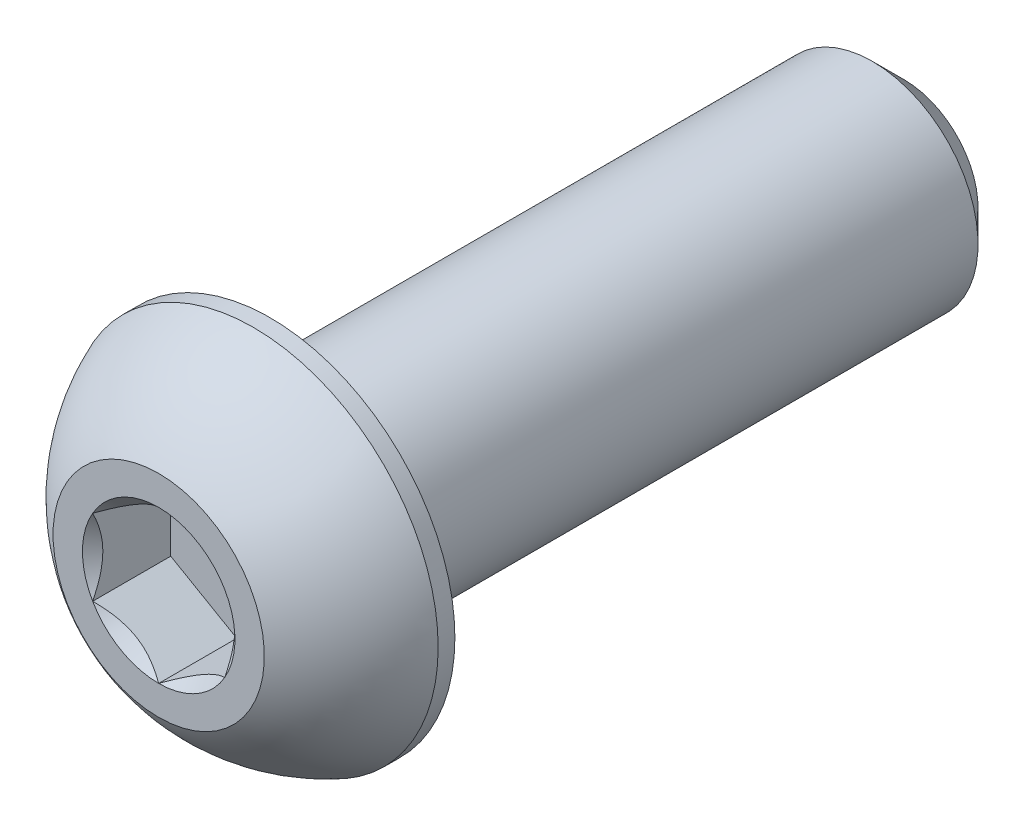
ISO-10303-21;
HEADER;
FILE_DESCRIPTION(('STEP AP214'),'2;1');
FILE_NAME('part.step','',(''),(''),'','','');
FILE_SCHEMA(('AUTOMOTIVE_DESIGN { 1 0 10303 214 1 1 1 1 }'));
ENDSEC;
DATA;
#1=APPLICATION_CONTEXT('core data for automotive mechanical design processes');
#2=APPLICATION_PROTOCOL_DEFINITION('international standard','automotive_design',2000,#1);
#3=PRODUCT_CONTEXT('',#1,'mechanical');
#4=PRODUCT('Part','Part','',(#3));
#5=PRODUCT_RELATED_PRODUCT_CATEGORY('part','',(#4));
#6=PRODUCT_DEFINITION_FORMATION('','',#4);
#7=PRODUCT_DEFINITION_CONTEXT('part definition',#1,'design');
#8=PRODUCT_DEFINITION('design','',#6,#7);
#9=PRODUCT_DEFINITION_SHAPE('','',#8);
#10=(LENGTH_UNIT() NAMED_UNIT(*) SI_UNIT(.MILLI.,.METRE.));
#11=(NAMED_UNIT(*) PLANE_ANGLE_UNIT() SI_UNIT($,.RADIAN.));
#12=(NAMED_UNIT(*) SI_UNIT($,.STERADIAN.) SOLID_ANGLE_UNIT());
#13=UNCERTAINTY_MEASURE_WITH_UNIT(LENGTH_MEASURE(1.E-05),#10,'distance_accuracy_value','');
#14=(GEOMETRIC_REPRESENTATION_CONTEXT(3) GLOBAL_UNCERTAINTY_ASSIGNED_CONTEXT((#13)) GLOBAL_UNIT_ASSIGNED_CONTEXT((#10,
#11,#12)) REPRESENTATION_CONTEXT('',''));
#15=CARTESIAN_POINT('',(0.,0.,0.));
#16=DIRECTION('',(0.,0.,1.));
#17=DIRECTION('',(1.,0.,0.));
#18=AXIS2_PLACEMENT_3D('',#15,#16,#17);
#19=CARTESIAN_POINT('',(0.,-3.17500000000001,-22.4028));
#20=DIRECTION('',(0.,0.,-1.));
#21=DIRECTION('',(0.,1.,0.));
#22=AXIS2_PLACEMENT_3D('',#19,#20,#21);
#23=PLANE('',#22);
#24=CARTESIAN_POINT('',(0.,0.,-22.4028));
#25=DIRECTION('',(0.,0.,-1.));
#26=DIRECTION('',(0.,1.,0.));
#27=AXIS2_PLACEMENT_3D('',#24,#25,#26);
#28=CIRCLE('',#27,2.2225);
#29=CARTESIAN_POINT('',(0.,2.2225,-22.4028));
#30=VERTEX_POINT('',#29);
#31=EDGE_CURVE('E175',#30,#30,#28,.T.);
#32=ORIENTED_EDGE('',*,*,#31,.T.);
#33=EDGE_LOOP('',(#32));
#34=FACE_BOUND('',#33,.T.);
#35=ADVANCED_FACE('F35',(#34),#23,.T.);
#36=CARTESIAN_POINT('',(0.,0.,-22.4028));
#37=DIRECTION('',(0.,0.,-1.));
#38=DIRECTION('',(0.,1.,0.));
#39=AXIS2_PLACEMENT_3D('',#36,#37,#38);
#40=CYLINDRICAL_SURFACE('',#39,3.175);
#41=CARTESIAN_POINT('',(0.,0.,-21.4503));
#42=DIRECTION('',(0.,0.,-1.));
#43=DIRECTION('',(0.,1.,0.));
#44=AXIS2_PLACEMENT_3D('',#41,#42,#43);
#45=CIRCLE('',#44,3.175);
#46=CARTESIAN_POINT('',(0.,3.175,-21.4503));
#47=VERTEX_POINT('',#46);
#48=EDGE_CURVE('E49',#47,#47,#45,.F.);
#49=ORIENTED_EDGE('',*,*,#48,.T.);
#50=EDGE_LOOP('',(#49));
#51=FACE_BOUND('',#50,.T.);
#52=CARTESIAN_POINT('',(0.,0.,-3.3528));
#53=DIRECTION('',(0.,0.,1.));
#54=DIRECTION('',(1.,0.,0.));
#55=AXIS2_PLACEMENT_3D('',#52,#53,#54);
#56=CIRCLE('',#55,3.175);
#57=CARTESIAN_POINT('',(3.175,0.,-3.3528));
#58=VERTEX_POINT('',#57);
#59=EDGE_CURVE('E172',#58,#58,#56,.F.);
#60=ORIENTED_EDGE('',*,*,#59,.T.);
#61=EDGE_LOOP('',(#60));
#62=FACE_BOUND('',#61,.T.);
#63=ADVANCED_FACE('F180',(#51,#62),#40,.T.);
#64=CARTESIAN_POINT('',(0.,0.,-22.4028));
#65=DIRECTION('',(0.,0.,1.));
#66=DIRECTION('',(0.,-1.,0.));
#67=AXIS2_PLACEMENT_3D('',#64,#65,#66);
#68=CONICAL_SURFACE('',#67,2.2225,0.785398163397447);
#69=ORIENTED_EDGE('',*,*,#48,.F.);
#70=EDGE_LOOP('',(#69));
#71=FACE_BOUND('',#70,.T.);
#72=ORIENTED_EDGE('',*,*,#31,.F.);
#73=EDGE_LOOP('',(#72));
#74=FACE_BOUND('',#73,.T.);
#75=ADVANCED_FACE('F37',(#71,#74),#68,.T.);
#76=CARTESIAN_POINT('',(0.,0.,-5.060315));
#77=DIRECTION('',(0.,0.,1.));
#78=DIRECTION('',(0.,-1.,0.));
#79=AXIS2_PLACEMENT_3D('',#76,#77,#78);
#80=SPHERICAL_SURFACE('',#79,5.97389428256184);
#81=CARTESIAN_POINT('',(0.,0.,0.));
#82=DIRECTION('',(0.,0.,1.));
#83=DIRECTION('',(1.,0.,0.));
#84=AXIS2_PLACEMENT_3D('',#81,#82,#83);
#85=CIRCLE('',#84,3.175);
#86=CARTESIAN_POINT('',(0.,-3.175,0.));
#87=VERTEX_POINT('',#86);
#88=EDGE_CURVE('E169',#87,#87,#85,.T.);
#89=CARTESIAN_POINT('',(0.,0.,-2.84988));
#90=DIRECTION('',(0.,0.,1.));
#91=DIRECTION('',(1.,0.,0.));
#92=AXIS2_PLACEMENT_3D('',#89,#90,#91);
#93=CIRCLE('',#92,5.5499);
#94=CARTESIAN_POINT('',(0.,-5.5499,-2.84988));
#95=VERTEX_POINT('',#94);
#96=EDGE_CURVE('E163',#95,#95,#93,.T.);
#97=CARTESIAN_POINT('',(0.,-3.175,0.));
#98=CARTESIAN_POINT('',(0.,-3.20828343957184,-0.0208830076580502));
#99=CARTESIAN_POINT('',(0.,-3.24136078860705,-0.0420944789280503));
#100=CARTESIAN_POINT('',(0.,-3.30709055775141,-0.0851658910984718));
#101=CARTESIAN_POINT('',(0.,-3.33974297786056,-0.107025831998893));
#102=CARTESIAN_POINT('',(0.,-3.40461014130008,-0.151385725836676));
#103=CARTESIAN_POINT('',(0.,-3.43682488463043,-0.173885678774039));
#104=CARTESIAN_POINT('',(0.,-3.50080416139461,-0.219516822259479));
#105=CARTESIAN_POINT('',(0.,-3.53256869482844,-0.242648012807557));
#106=CARTESIAN_POINT('',(0.,-3.59563518208834,-0.289532629449102));
#107=CARTESIAN_POINT('',(0.,-3.62693713591442,-0.313286055542569));
#108=CARTESIAN_POINT('',(0.,-3.68906627753106,-0.36140589409133));
#109=CARTESIAN_POINT('',(0.,-3.71989346532163,-0.385772306546626));
#110=CARTESIAN_POINT('',(0.,-3.78106107243204,-0.435108631276877));
#111=CARTESIAN_POINT('',(0.,-3.8114014917519,-0.460078543551833));
#112=CARTESIAN_POINT('',(0.,-3.87158374923259,-0.510612146063938));
#113=CARTESIAN_POINT('',(0.,-3.90142558739343,-0.536175836301086));
#114=CARTESIAN_POINT('',(0.,-3.96059906392414,-0.587887041792083));
#115=CARTESIAN_POINT('',(0.,-3.989930702294,-0.614034557045931));
#116=CARTESIAN_POINT('',(0.,-4.04807235926832,-0.666903232293407));
#117=CARTESIAN_POINT('',(0.,-4.07688237787279,-0.693624392287034));
#118=CARTESIAN_POINT('',(0.,-4.13396957842491,-0.747629953401057));
#119=CARTESIAN_POINT('',(0.,-4.16224676037257,-0.774914354521453));
#120=CARTESIAN_POINT('',(0.,-4.21825727817542,-0.830035774981947));
#121=CARTESIAN_POINT('',(0.,-4.24599061403061,-0.857872794322045));
#122=CARTESIAN_POINT('',(0.,-4.30090264195357,-0.91408861315902));
#123=CARTESIAN_POINT('',(0.,-4.32808133402134,-0.942467412655899));
#124=CARTESIAN_POINT('',(0.,-4.38187349261953,-0.999755742806741));
#125=CARTESIAN_POINT('',(0.,-4.40848695914995,-1.0286652734607));
#126=CARTESIAN_POINT('',(0.,-4.46113830498838,-1.08700381029123));
#127=CARTESIAN_POINT('',(0.,-4.48717618429639,-1.11643281646778));
#128=CARTESIAN_POINT('',(0.,-4.53866621810402,-1.17579884645643));
#129=CARTESIAN_POINT('',(0.,-4.56411837260364,-1.20573587026853));
#130=CARTESIAN_POINT('',(0.,-4.61442704725457,-1.26610627984964));
#131=CARTESIAN_POINT('',(0.,-4.63928356740587,-1.29653966561866));
#132=CARTESIAN_POINT('',(0.,-4.68839129572448,-1.3578909501815));
#133=CARTESIAN_POINT('',(0.,-4.71264250389178,-1.38880884897531));
#134=CARTESIAN_POINT('',(0.,-4.76053016627881,-1.45111712201534));
#135=CARTESIAN_POINT('',(0.,-4.78416662049853,-1.48250749626155));
#136=CARTESIAN_POINT('',(0.,-4.8308155723751,-1.54574849868041));
#137=CARTESIAN_POINT('',(0.,-4.85382807003194,-1.57759912685306));
#138=CARTESIAN_POINT('',(0.,-4.89922014909859,-1.64174823640362));
#139=CARTESIAN_POINT('',(0.,-4.92159973050841,-1.67404671778154));
#140=CARTESIAN_POINT('',(0.,-4.96571726381658,-1.73907895865427));
#141=CARTESIAN_POINT('',(0.,-4.98745521571493,-1.77181271814908));
#142=CARTESIAN_POINT('',(0.,-5.03028102654719,-1.83770277069632));
#143=CARTESIAN_POINT('',(0.,-5.0513688854811,-1.87085906374874));
#144=CARTESIAN_POINT('',(0.,-5.09288630004063,-1.93758127434189));
#145=CARTESIAN_POINT('',(0.,-5.11331585566624,-1.97114719188261));
#146=CARTESIAN_POINT('',(0.,-5.15350870956168,-2.03867558290299));
#147=CARTESIAN_POINT('',(0.,-5.17327200783151,-2.07263805638265));
#148=CARTESIAN_POINT('',(0.,-5.21212465239608,-2.14094633632486));
#149=CARTESIAN_POINT('',(0.,-5.23121399869082,-2.17529214278741));
#150=CARTESIAN_POINT('',(0.,-5.26871130697935,-2.2443537165359));
#151=CARTESIAN_POINT('',(0.,-5.28711926897315,-2.27906948382184));
#152=CARTESIAN_POINT('',(0.,-5.32324664200827,-2.3488574628552));
#153=CARTESIAN_POINT('',(0.,-5.3409660530496,-2.38392967460262));
#154=CARTESIAN_POINT('',(0.,-5.37570942417474,-2.45441688802313));
#155=CARTESIAN_POINT('',(0.,-5.39273338425856,-2.48983188969622));
#156=CARTESIAN_POINT('',(0.,-5.42607922958184,-2.56099089271574));
#157=CARTESIAN_POINT('',(0.,-5.44240111482132,-2.59673489406217));
#158=CARTESIAN_POINT('',(0.,-5.47433643994316,-2.66853798649801));
#159=CARTESIAN_POINT('',(0.,-5.48994987982553,-2.70459707758742));
#160=CARTESIAN_POINT('',(0.,-5.52046229408188,-2.77701628549785));
#161=CARTESIAN_POINT('',(0.,-5.53536126845586,-2.81337640231887));
#162=CARTESIAN_POINT('',(0.,-5.5499,-2.84988));
#163=B_SPLINE_CURVE_WITH_KNOTS('',3,(#97,#98,#99,#100,#101,#102,#103,#104,#105,#106,#107,#108,
#109,#110,#111,#112,#113,#114,#115,#116,#117,#118,#119,#120,#121,#122,#123,#124,#125,#126,#127,
#128,#129,#130,#131,#132,#133,#134,#135,#136,#137,#138,#139,#140,#141,#142,#143,#144,#145,#146,
#147,#148,#149,#150,#151,#152,#153,#154,#155,#156,#157,#158,#159,#160,#161,#162),.UNSPECIFIED.,
.F.,.F.,(4,2,2,2,2,2,2,2,2,2,2,2,2,2,2,2,2,2,2,2,2,2,2,2,2,2,2,2,2,2,2,2,4),(0.,0.1178750807537,
0.235750161507399,0.353625242261099,0.471500323014798,0.589375403768498,0.707250484522198,
0.825125565275897,0.943000646029597,1.0608757267833,1.17875080753699,1.2966258882907,
1.41450096904439,1.53237604979809,1.65025113055179,1.76812621130549,1.88600129205919,
2.00387637281289,2.12175145356659,2.23962653432029,2.35750161507399,2.47537669582769,
2.59325177658139,2.71112685733509,2.82900193808879,2.94687701884249,3.06475209959619,
3.18262718034989,3.30050226110359,3.41837734185729,3.53625242261099,3.65412750336469,
3.77200258411839),.UNSPECIFIED.);
#164=EDGE_CURVE('BSEAM185',#87,#95,#163,.T.);
#165=ORIENTED_EDGE('',*,*,#88,.F.);
#166=ORIENTED_EDGE('',*,*,#96,.T.);
#167=ORIENTED_EDGE('',*,*,#164,.T.);
#168=ORIENTED_EDGE('',*,*,#164,.F.);
#169=EDGE_LOOP('',(#165,#167,#166,#168));
#170=FACE_BOUND('',#169,.T.);
#171=ADVANCED_FACE('F185',(#170),#80,.T.);
#172=CARTESIAN_POINT('',(0.,-3.175,0.));
#173=DIRECTION('',(0.,0.,-1.));
#174=DIRECTION('',(-1.,0.,0.));
#175=AXIS2_PLACEMENT_3D('',#172,#173,#174);
#176=PLANE('',#175);
#177=CARTESIAN_POINT('',(0.,0.,0.));
#178=DIRECTION('',(0.,0.,1.));
#179=DIRECTION('',(1.,0.,0.));
#180=AXIS2_PLACEMENT_3D('',#177,#178,#179);
#181=CIRCLE('',#180,2.29135888084633);
#182=CARTESIAN_POINT('',(-1.984375,1.14567944042316,0.));
#183=VERTEX_POINT('',#182);
#184=CARTESIAN_POINT('',(-1.984375,-1.14567944042316,0.));
#185=VERTEX_POINT('',#184);
#186=EDGE_CURVE('E62',#183,#185,#181,.T.);
#187=ORIENTED_EDGE('',*,*,#186,.F.);
#188=CARTESIAN_POINT('',(0.,2.29135888084633,0.));
#189=VERTEX_POINT('',#188);
#190=EDGE_CURVE('E134',#189,#183,#181,.T.);
#191=ORIENTED_EDGE('',*,*,#190,.F.);
#192=CARTESIAN_POINT('',(1.984375,1.14567944042316,0.));
#193=VERTEX_POINT('',#192);
#194=EDGE_CURVE('E131',#193,#189,#181,.T.);
#195=ORIENTED_EDGE('',*,*,#194,.F.);
#196=CARTESIAN_POINT('',(1.984375,-1.14567944042316,0.));
#197=VERTEX_POINT('',#196);
#198=EDGE_CURVE('E102',#197,#193,#181,.T.);
#199=ORIENTED_EDGE('',*,*,#198,.F.);
#200=CARTESIAN_POINT('',(0.,-2.29135888084633,0.));
#201=VERTEX_POINT('',#200);
#202=EDGE_CURVE('E94',#201,#197,#181,.T.);
#203=ORIENTED_EDGE('',*,*,#202,.F.);
#204=EDGE_CURVE('E55',#185,#201,#181,.T.);
#205=ORIENTED_EDGE('',*,*,#204,.F.);
#206=EDGE_LOOP('',(#187,#191,#195,#199,#203,#205));
#207=FACE_BOUND('',#206,.T.);
#208=ORIENTED_EDGE('',*,*,#88,.T.);
#209=EDGE_LOOP('',(#208));
#210=FACE_BOUND('',#209,.T.);
#211=ADVANCED_FACE('F128',(#207,#210),#176,.F.);
#212=CARTESIAN_POINT('',(0.,-5.5499,-3.3528));
#213=DIRECTION('',(0.,0.,1.));
#214=DIRECTION('',(1.,0.,0.));
#215=AXIS2_PLACEMENT_3D('',#212,#213,#214);
#216=PLANE('',#215);
#217=ORIENTED_EDGE('',*,*,#59,.F.);
#218=EDGE_LOOP('',(#217));
#219=FACE_BOUND('',#218,.T.);
#220=CARTESIAN_POINT('',(0.,0.,-3.3528));
#221=DIRECTION('',(0.,0.,1.));
#222=DIRECTION('',(1.,0.,0.));
#223=AXIS2_PLACEMENT_3D('',#220,#221,#222);
#224=CIRCLE('',#223,5.5499);
#225=CARTESIAN_POINT('',(5.5499,0.,-3.3528));
#226=VERTEX_POINT('',#225);
#227=EDGE_CURVE('E166',#226,#226,#224,.T.);
#228=ORIENTED_EDGE('',*,*,#227,.F.);
#229=EDGE_LOOP('',(#228));
#230=FACE_BOUND('',#229,.T.);
#231=ADVANCED_FACE('F199',(#219,#230),#216,.F.);
#232=CARTESIAN_POINT('',(0.,0.,0.));
#233=DIRECTION('',(0.,0.,1.));
#234=DIRECTION('',(1.,0.,0.));
#235=AXIS2_PLACEMENT_3D('',#232,#233,#234);
#236=CYLINDRICAL_SURFACE('',#235,5.5499);
#237=ORIENTED_EDGE('',*,*,#96,.F.);
#238=EDGE_LOOP('',(#237));
#239=FACE_BOUND('',#238,.T.);
#240=ORIENTED_EDGE('',*,*,#227,.T.);
#241=EDGE_LOOP('',(#240));
#242=FACE_BOUND('',#241,.T.);
#243=ADVANCED_FACE('F202',(#239,#242),#236,.T.);
#244=CARTESIAN_POINT('',(0.,0.,0.));
#245=DIRECTION('',(0.,0.,1.));
#246=DIRECTION('',(1.,0.,0.));
#247=AXIS2_PLACEMENT_3D('',#244,#245,#246);
#248=CONICAL_SURFACE('',#247,2.29135888084633,0.78539816339745);
#249=ORIENTED_EDGE('',*,*,#198,.T.);
#250=CARTESIAN_POINT('',(1.984375,-2.28495242157822,0.734984078816568));
#251=CARTESIAN_POINT('',(1.984375,-2.22931635455402,0.692986685550762));
#252=CARTESIAN_POINT('',(1.984375,-2.17336876548389,0.651396054076336));
#253=CARTESIAN_POINT('',(1.984375,-2.06072770258171,0.569208461471479));
#254=CARTESIAN_POINT('',(1.984375,-2.00403404503435,0.528611752405042));
#255=CARTESIAN_POINT('',(1.984375,-1.88936329173488,0.448303503174668));
#256=CARTESIAN_POINT('',(1.984375,-1.83137965519348,0.408601258813307));
#257=CARTESIAN_POINT('',(1.984375,-1.7144280213784,0.330685173401292));
#258=CARTESIAN_POINT('',(1.984375,-1.65546009407228,0.292471227194368));
#259=CARTESIAN_POINT('',(1.984375,-1.47005472306035,0.176252834013637));
#260=CARTESIAN_POINT('',(1.984375,-1.34163909427883,0.101347886872381));
#261=CARTESIAN_POINT('',(1.984375,-1.0784038470548,-0.0356697845602627));
#262=CARTESIAN_POINT('',(1.984375,-0.943607781407424,-0.0978256335176254));
#263=CARTESIAN_POINT('',(1.984375,-0.741275100444881,-0.173867421311381));
#264=CARTESIAN_POINT('',(1.984375,-0.676735408881095,-0.195691938673995));
#265=CARTESIAN_POINT('',(1.984375,-0.546098118112761,-0.234159536462205));
#266=CARTESIAN_POINT('',(1.984375,-0.480000411919955,-0.250802259934452));
#267=CARTESIAN_POINT('',(1.984375,-0.347746170028531,-0.277764619130277));
#268=CARTESIAN_POINT('',(1.984375,-0.281612071479122,-0.288192590264109));
#269=CARTESIAN_POINT('',(1.984375,-0.14863662005235,-0.302521852623404));
#270=CARTESIAN_POINT('',(1.984375,-0.0817953907393235,-0.306424265772614));
#271=CARTESIAN_POINT('',(1.984375,0.0495156750890644,-0.307412948667327));
#272=CARTESIAN_POINT('',(1.984375,0.113983775102991,-0.304740821124985));
#273=CARTESIAN_POINT('',(1.984375,0.242367515846177,-0.293260789502485));
#274=CARTESIAN_POINT('',(1.984375,0.30628310229592,-0.284452289360786));
#275=CARTESIAN_POINT('',(1.984375,0.434181040262184,-0.261030978667103));
#276=CARTESIAN_POINT('',(1.984375,0.498145026858309,-0.246319393767914));
#277=CARTESIAN_POINT('',(1.984375,0.624675616953007,-0.211873818587874));
#278=CARTESIAN_POINT('',(1.984375,0.687242336899689,-0.192140248550805));
#279=CARTESIAN_POINT('',(1.984375,0.884225483826088,-0.12258776276924));
#280=CARTESIAN_POINT('',(1.984375,1.01583674256468,-0.0648475887435034));
#281=CARTESIAN_POINT('',(1.984375,1.27288659242652,0.063530336588798));
#282=CARTESIAN_POINT('',(1.984375,1.3983008827048,0.134214424919413));
#283=CARTESIAN_POINT('',(1.984375,1.57956687990221,0.244516663813199));
#284=CARTESIAN_POINT('',(1.984375,1.63738271299424,0.280969829475364));
#285=CARTESIAN_POINT('',(1.984375,1.75202215386202,0.355415963291705));
#286=CARTESIAN_POINT('',(1.984375,1.80884568601362,0.393409048078054));
#287=CARTESIAN_POINT('',(1.984375,1.92116923084255,0.470338808893091));
#288=CARTESIAN_POINT('',(1.984375,1.97667624512253,0.509265313038791));
#289=CARTESIAN_POINT('',(1.984375,2.08693170717166,0.588147746121386));
#290=CARTESIAN_POINT('',(1.984375,2.14168035934793,0.62810338902403));
#291=CARTESIAN_POINT('',(1.984375,2.19611149046622,0.668480611285427));
#292=B_SPLINE_CURVE_WITH_KNOTS('',3,(#250,#251,#252,#253,#254,#255,#256,#257,#258,#259,#260,
#261,#262,#263,#264,#265,#266,#267,#268,#269,#270,#271,#272,#273,#274,#275,#276,#277,#278,#279,
#280,#281,#282,#283,#284,#285,#286,#287,#288,#289,#290,#291),.UNSPECIFIED.,.F.,.F.,(4,2,2,2,2,2,
2,2,2,2,2,2,2,2,2,2,2,2,2,2,4),(0.,0.209126070008322,0.418304637356569,0.629103979977992,
0.839888401371185,1.28549951116127,1.72957750768351,1.93379389749971,2.13802435186698,
2.33858179514334,2.53910475350639,2.73236963400794,2.92565329006887,3.12231577097487,
3.31896180041345,3.74886295245172,4.18033428125362,4.3853601718029,4.59040161996383,
4.79377749165108,4.99709743524131),.UNSPECIFIED.);
#293=EDGE_CURVE('E11',#197,#193,#292,.T.);
#294=ORIENTED_EDGE('',*,*,#293,.F.);
#295=EDGE_LOOP('',(#249,#294));
#296=FACE_BOUND('',#295,.T.);
#297=ADVANCED_FACE('F106',(#296),#248,.F.);
#298=ORIENTED_EDGE('',*,*,#194,.T.);
#299=CARTESIAN_POINT('',(1.984575,1.14556397036933,0.000115478781843379));
#300=CARTESIAN_POINT('',(1.9163590048332,1.18494849354192,-0.0392371477360855));
#301=CARTESIAN_POINT('',(1.84700231489303,1.22499159714897,-0.0762786895538155));
#302=CARTESIAN_POINT('',(1.70557619954781,1.30664400291398,-0.144101141576677));
#303=CARTESIAN_POINT('',(1.63349332126322,1.34826107209555,-0.174844310908246));
#304=CARTESIAN_POINT('',(1.488141602734,1.43217992591557,-0.227508111188786));
#305=CARTESIAN_POINT('',(1.41490978751306,1.47446033414663,-0.249561124120036));
#306=CARTESIAN_POINT('',(1.26683381740529,1.55995203534886,-0.283538507056124));
#307=CARTESIAN_POINT('',(1.19199418724658,1.60316071596705,-0.295488243908271));
#308=CARTESIAN_POINT('',(1.06301458545618,1.6776271237807,-0.306269900918094));
#309=CARTESIAN_POINT('',(1.00904128422756,1.7087886237741,-0.30786610094093));
#310=CARTESIAN_POINT('',(0.901182881480199,1.77106070163465,-0.305178161134708));
#311=CARTESIAN_POINT('',(0.847297817514476,1.80217125782056,-0.300891959659541));
#312=CARTESIAN_POINT('',(0.740036461751395,1.86409863044402,-0.286683126986481));
#313=CARTESIAN_POINT('',(0.686660807239859,1.89491507894443,-0.276754189547727));
#314=CARTESIAN_POINT('',(0.580832482591103,1.95601509066828,-0.251804915725461));
#315=CARTESIAN_POINT('',(0.528379742028898,1.9862986945516,-0.236784969610512));
#316=CARTESIAN_POINT('',(0.394017661036351,2.06387267818152,-0.19219214836433));
#317=CARTESIAN_POINT('',(0.312941642841675,2.11068193911104,-0.159257004061667));
#318=CARTESIAN_POINT('',(0.19372669327016,2.17951072233758,-0.103657558797803));
#319=CARTESIAN_POINT('',(0.154440075613998,2.20219286161692,-0.0841224079481375));
#320=CARTESIAN_POINT('',(0.0765946381319467,2.24713694590237,-0.0432712618805984));
#321=CARTESIAN_POINT('',(0.0380353888983008,2.26939913882716,-0.0219563604316496));
#322=CARTESIAN_POINT('',(-0.00020000000000058,2.29147435090017,0.000115478781842942));
#323=B_SPLINE_CURVE_WITH_KNOTS('',3,(#299,#300,#301,#302,#303,#304,#305,#306,#307,#308,#309,
#310,#311,#312,#313,#314,#315,#316,#317,#318,#319,#320,#321,#322),.UNSPECIFIED.,.F.,.F.,(4,2,2,
2,2,2,2,2,2,2,2,4),(0.,0.264339630306627,0.530219665093694,0.79187641637146,1.05287424418109,
1.239639843932,1.42647091743852,1.61351120244035,1.8005371524754,2.09764209964316,
2.24579179873714,2.39385111134157),.UNSPECIFIED.);
#324=EDGE_CURVE('E133',#193,#189,#323,.T.);
#325=ORIENTED_EDGE('',*,*,#324,.F.);
#326=EDGE_LOOP('',(#298,#325));
#327=FACE_BOUND('',#326,.T.);
#328=ADVANCED_FACE('F287',(#327),#248,.F.);
#329=ORIENTED_EDGE('',*,*,#190,.T.);
#330=CARTESIAN_POINT('',(0.000199999999999608,2.29147435090017,0.000115478781843248));
#331=CARTESIAN_POINT('',(-0.0680159951668025,2.25208982772757,-0.0392371477360854));
#332=CARTESIAN_POINT('',(-0.137372685106966,2.21204672412052,-0.0762786895538155));
#333=CARTESIAN_POINT('',(-0.278798800452188,2.13039431835551,-0.144101141576677));
#334=CARTESIAN_POINT('',(-0.350881678736783,2.08877724917394,-0.174844310908246));
#335=CARTESIAN_POINT('',(-0.496233397266004,2.00485839535392,-0.227508111188786));
#336=CARTESIAN_POINT('',(-0.569465212486939,1.96257798712287,-0.249561124120036));
#337=CARTESIAN_POINT('',(-0.717541182594707,1.87708628592063,-0.283538507056124));
#338=CARTESIAN_POINT('',(-0.792380812753425,1.83387760530244,-0.295488243908272));
#339=CARTESIAN_POINT('',(-0.921360414543816,1.75941119748879,-0.306269900918094));
#340=CARTESIAN_POINT('',(-0.975333715772443,1.72824969749539,-0.307866100940931));
#341=CARTESIAN_POINT('',(-1.0831921185198,1.66597761963484,-0.305178161134708));
#342=CARTESIAN_POINT('',(-1.13707718248552,1.63486706344893,-0.300891959659541));
#343=CARTESIAN_POINT('',(-1.2443385382486,1.57293969082547,-0.286683126986481));
#344=CARTESIAN_POINT('',(-1.29771419276014,1.54212324232506,-0.276754189547727));
#345=CARTESIAN_POINT('',(-1.4035425174089,1.48102323060122,-0.251804915725462));
#346=CARTESIAN_POINT('',(-1.4559952579711,1.45073962671789,-0.236784969610512));
#347=CARTESIAN_POINT('',(-1.59035733896365,1.37316564308797,-0.19219214836433));
#348=CARTESIAN_POINT('',(-1.67143335715832,1.32635638215845,-0.159257004061668));
#349=CARTESIAN_POINT('',(-1.79064830672984,1.25752759893191,-0.103657558797804));
#350=CARTESIAN_POINT('',(-1.829934924386,1.23484545965257,-0.0841224079481378));
#351=CARTESIAN_POINT('',(-1.90778036186805,1.18990137536712,-0.0432712618805986));
#352=CARTESIAN_POINT('',(-1.9463396111017,1.16763918244233,-0.0219563604316498));
#353=CARTESIAN_POINT('',(-1.984575,1.14556397036933,0.000115478781842511));
#354=B_SPLINE_CURVE_WITH_KNOTS('',3,(#330,#331,#332,#333,#334,#335,#336,#337,#338,#339,#340,
#341,#342,#343,#344,#345,#346,#347,#348,#349,#350,#351,#352,#353),.UNSPECIFIED.,.F.,.F.,(4,2,2,
2,2,2,2,2,2,2,2,4),(0.,0.264339630306627,0.530219665093694,0.791876416371461,1.05287424418109,
1.239639843932,1.42647091743852,1.61351120244035,1.8005371524754,2.09764209964316,
2.24579179873714,2.39385111134157),.UNSPECIFIED.);
#355=EDGE_CURVE('E138',#189,#183,#354,.T.);
#356=ORIENTED_EDGE('',*,*,#355,.F.);
#357=EDGE_LOOP('',(#329,#356));
#358=FACE_BOUND('',#357,.T.);
#359=ADVANCED_FACE('F141',(#358),#248,.F.);
#360=ORIENTED_EDGE('',*,*,#186,.T.);
#361=CARTESIAN_POINT('',(-1.984375,-2.28495242157823,0.734984078816569));
#362=CARTESIAN_POINT('',(-1.984375,-2.22931635455402,0.692986685550762));
#363=CARTESIAN_POINT('',(-1.984375,-2.17336876548389,0.651396054076336));
#364=CARTESIAN_POINT('',(-1.984375,-2.06072770258171,0.56920846147148));
#365=CARTESIAN_POINT('',(-1.984375,-2.00403404503435,0.528611752405043));
#366=CARTESIAN_POINT('',(-1.984375,-1.88936329173489,0.448303503174669));
#367=CARTESIAN_POINT('',(-1.984375,-1.83137965519348,0.408601258813308));
#368=CARTESIAN_POINT('',(-1.984375,-1.7144280213784,0.330685173401292));
#369=CARTESIAN_POINT('',(-1.984375,-1.65546009407228,0.292471227194368));
#370=CARTESIAN_POINT('',(-1.984375,-1.47005472306035,0.176252834013636));
#371=CARTESIAN_POINT('',(-1.984375,-1.34163909427883,0.101347886872382));
#372=CARTESIAN_POINT('',(-1.984375,-1.0784038470548,-0.0356697845602624));
#373=CARTESIAN_POINT('',(-1.984375,-0.943607781407425,-0.0978256335176256));
#374=CARTESIAN_POINT('',(-1.984375,-0.741275100444882,-0.173867421311381));
#375=CARTESIAN_POINT('',(-1.984375,-0.676735408881095,-0.195691938673995));
#376=CARTESIAN_POINT('',(-1.984375,-0.546098118112762,-0.234159536462205));
#377=CARTESIAN_POINT('',(-1.984375,-0.480000411919956,-0.250802259934452));
#378=CARTESIAN_POINT('',(-1.984375,-0.347746170028532,-0.277764619130277));
#379=CARTESIAN_POINT('',(-1.984375,-0.281612071479123,-0.288192590264108));
#380=CARTESIAN_POINT('',(-1.984375,-0.14863662005235,-0.302521852623404));
#381=CARTESIAN_POINT('',(-1.984375,-0.0817953907393237,-0.306424265772614));
#382=CARTESIAN_POINT('',(-1.984375,0.0495156750890643,-0.307412948667328));
#383=CARTESIAN_POINT('',(-1.984375,0.113983775102991,-0.304740821124985));
#384=CARTESIAN_POINT('',(-1.984375,0.242367515846177,-0.293260789502485));
#385=CARTESIAN_POINT('',(-1.984375,0.306283102295919,-0.284452289360786));
#386=CARTESIAN_POINT('',(-1.984375,0.434181040262184,-0.261030978667103));
#387=CARTESIAN_POINT('',(-1.984375,0.498145026858309,-0.246319393767914));
#388=CARTESIAN_POINT('',(-1.984375,0.624675616953007,-0.211873818587874));
#389=CARTESIAN_POINT('',(-1.984375,0.687242336899689,-0.192140248550805));
#390=CARTESIAN_POINT('',(-1.984375,0.884225483826087,-0.12258776276924));
#391=CARTESIAN_POINT('',(-1.984375,1.01583674256468,-0.0648475887435036));
#392=CARTESIAN_POINT('',(-1.984375,1.27288659242652,0.0635303365887976));
#393=CARTESIAN_POINT('',(-1.984375,1.3983008827048,0.134214424919412));
#394=CARTESIAN_POINT('',(-1.984375,1.57956687990221,0.244516663813198));
#395=CARTESIAN_POINT('',(-1.984375,1.63738271299424,0.280969829475363));
#396=CARTESIAN_POINT('',(-1.984375,1.75202215386202,0.355415963291704));
#397=CARTESIAN_POINT('',(-1.984375,1.80884568601362,0.393409048078054));
#398=CARTESIAN_POINT('',(-1.984375,1.92116923084255,0.47033880889309));
#399=CARTESIAN_POINT('',(-1.984375,1.97667624512253,0.509265313038791));
#400=CARTESIAN_POINT('',(-1.984375,2.08693170717166,0.588147746121386));
#401=CARTESIAN_POINT('',(-1.984375,2.14168035934793,0.628103389024029));
#402=CARTESIAN_POINT('',(-1.984375,2.19611149046622,0.668480611285426));
#403=B_SPLINE_CURVE_WITH_KNOTS('',3,(#361,#362,#363,#364,#365,#366,#367,#368,#369,#370,#371,
#372,#373,#374,#375,#376,#377,#378,#379,#380,#381,#382,#383,#384,#385,#386,#387,#388,#389,#390,
#391,#392,#393,#394,#395,#396,#397,#398,#399,#400,#401,#402),.UNSPECIFIED.,.F.,.F.,(4,2,2,2,2,2,
2,2,2,2,2,2,2,2,2,2,2,2,2,2,4),(0.,0.209126070008322,0.41830463735657,0.629103979977993,
0.839888401371186,1.28549951116127,1.72957750768351,1.93379389749972,2.13802435186698,
2.33858179514334,2.53910475350639,2.73236963400794,2.92565329006887,3.12231577097488,
3.31896180041345,3.74886295245172,4.18033428125362,4.3853601718029,4.59040161996383,
4.79377749165108,4.99709743524131),.UNSPECIFIED.);
#404=EDGE_CURVE('E145',#183,#185,#403,.F.);
#405=ORIENTED_EDGE('',*,*,#404,.F.);
#406=EDGE_LOOP('',(#360,#405));
#407=FACE_BOUND('',#406,.T.);
#408=ADVANCED_FACE('F281',(#407),#248,.F.);
#409=ORIENTED_EDGE('',*,*,#204,.T.);
#410=CARTESIAN_POINT('',(-1.984575,-1.14556397036933,0.000115478781843379));
#411=CARTESIAN_POINT('',(-1.9163590048332,-1.18494849354192,-0.0392371477360847));
#412=CARTESIAN_POINT('',(-1.84700231489303,-1.22499159714897,-0.0762786895538149));
#413=CARTESIAN_POINT('',(-1.70557619954781,-1.30664400291398,-0.144101141576677));
#414=CARTESIAN_POINT('',(-1.63349332126322,-1.34826107209555,-0.174844310908247));
#415=CARTESIAN_POINT('',(-1.488141602734,-1.43217992591557,-0.227508111188786));
#416=CARTESIAN_POINT('',(-1.41490978751306,-1.47446033414663,-0.249561124120036));
#417=CARTESIAN_POINT('',(-1.26683381740529,-1.55995203534886,-0.283538507056124));
#418=CARTESIAN_POINT('',(-1.19199418724658,-1.60316071596705,-0.295488243908271));
#419=CARTESIAN_POINT('',(-1.06301458545618,-1.6776271237807,-0.306269900918094));
#420=CARTESIAN_POINT('',(-1.00904128422756,-1.7087886237741,-0.30786610094093));
#421=CARTESIAN_POINT('',(-0.9011828814802,-1.77106070163465,-0.305178161134707));
#422=CARTESIAN_POINT('',(-0.847297817514477,-1.80217125782056,-0.30089195965954));
#423=CARTESIAN_POINT('',(-0.740036461751396,-1.86409863044402,-0.286683126986481));
#424=CARTESIAN_POINT('',(-0.68666080723986,-1.89491507894443,-0.276754189547727));
#425=CARTESIAN_POINT('',(-0.580832482591103,-1.95601509066828,-0.251804915725461));
#426=CARTESIAN_POINT('',(-0.528379742028898,-1.9862986945516,-0.236784969610511));
#427=CARTESIAN_POINT('',(-0.394017661036351,-2.06387267818152,-0.19219214836433));
#428=CARTESIAN_POINT('',(-0.312941642841675,-2.11068193911104,-0.159257004061667));
#429=CARTESIAN_POINT('',(-0.19372669327016,-2.17951072233758,-0.103657558797803));
#430=CARTESIAN_POINT('',(-0.154440075613998,-2.20219286161692,-0.0841224079481371));
#431=CARTESIAN_POINT('',(-0.0765946381319465,-2.24713694590237,-0.0432712618805977));
#432=CARTESIAN_POINT('',(-0.0380353888983009,-2.26939913882716,-0.0219563604316487));
#433=CARTESIAN_POINT('',(0.000200000000000425,-2.29147435090017,0.000115478781843735));
#434=B_SPLINE_CURVE_WITH_KNOTS('',3,(#410,#411,#412,#413,#414,#415,#416,#417,#418,#419,#420,
#421,#422,#423,#424,#425,#426,#427,#428,#429,#430,#431,#432,#433),.UNSPECIFIED.,.F.,.F.,(4,2,2,
2,2,2,2,2,2,2,2,4),(0.,0.264339630306627,0.530219665093694,0.79187641637146,1.05287424418109,
1.239639843932,1.42647091743852,1.61351120244035,1.8005371524754,2.09764209964316,
2.24579179873714,2.39385111134157),.UNSPECIFIED.);
#435=EDGE_CURVE('E118',#185,#201,#434,.T.);
#436=ORIENTED_EDGE('',*,*,#435,.F.);
#437=EDGE_LOOP('',(#409,#436));
#438=FACE_BOUND('',#437,.T.);
#439=ADVANCED_FACE('F229',(#438),#248,.F.);
#440=ORIENTED_EDGE('',*,*,#202,.T.);
#441=CARTESIAN_POINT('',(-0.000199999999999594,-2.29147435090017,0.000115478781843681));
#442=CARTESIAN_POINT('',(0.0680159951668032,-2.25208982772757,-0.0392371477360843));
#443=CARTESIAN_POINT('',(0.137372685106967,-2.21204672412052,-0.0762786895538144));
#444=CARTESIAN_POINT('',(0.278798800452188,-2.13039431835551,-0.144101141576676));
#445=CARTESIAN_POINT('',(0.350881678736783,-2.08877724917394,-0.174844310908246));
#446=CARTESIAN_POINT('',(0.496233397266004,-2.00485839535392,-0.227508111188787));
#447=CARTESIAN_POINT('',(0.569465212486939,-1.96257798712287,-0.249561124120036));
#448=CARTESIAN_POINT('',(0.717541182594707,-1.87708628592063,-0.283538507056124));
#449=CARTESIAN_POINT('',(0.792380812753425,-1.83387760530244,-0.295488243908272));
#450=CARTESIAN_POINT('',(0.921360414543816,-1.75941119748879,-0.306269900918094));
#451=CARTESIAN_POINT('',(0.975333715772443,-1.72824969749539,-0.30786610094093));
#452=CARTESIAN_POINT('',(1.0831921185198,-1.66597761963484,-0.305178161134708));
#453=CARTESIAN_POINT('',(1.13707718248552,-1.63486706344893,-0.300891959659541));
#454=CARTESIAN_POINT('',(1.2443385382486,-1.57293969082547,-0.286683126986481));
#455=CARTESIAN_POINT('',(1.29771419276014,-1.54212324232506,-0.276754189547727));
#456=CARTESIAN_POINT('',(1.4035425174089,-1.48102323060122,-0.251804915725462));
#457=CARTESIAN_POINT('',(1.4559952579711,-1.45073962671789,-0.236784969610512));
#458=CARTESIAN_POINT('',(1.59035733896365,-1.37316564308797,-0.19219214836433));
#459=CARTESIAN_POINT('',(1.67143335715832,-1.32635638215845,-0.159257004061668));
#460=CARTESIAN_POINT('',(1.79064830672984,-1.25752759893191,-0.103657558797804));
#461=CARTESIAN_POINT('',(1.829934924386,-1.23484545965257,-0.0841224079481379));
#462=CARTESIAN_POINT('',(1.90778036186805,-1.18990137536712,-0.0432712618805987));
#463=CARTESIAN_POINT('',(1.9463396111017,-1.16763918244233,-0.0219563604316498));
#464=CARTESIAN_POINT('',(1.984575,-1.14556397036933,0.000115478781842673));
#465=B_SPLINE_CURVE_WITH_KNOTS('',3,(#441,#442,#443,#444,#445,#446,#447,#448,#449,#450,#451,
#452,#453,#454,#455,#456,#457,#458,#459,#460,#461,#462,#463,#464),.UNSPECIFIED.,.F.,.F.,(4,2,2,
2,2,2,2,2,2,2,2,4),(0.,0.264339630306627,0.530219665093695,0.791876416371461,1.05287424418109,
1.239639843932,1.42647091743852,1.61351120244035,1.8005371524754,2.09764209964316,
2.24579179873714,2.39385111134157),.UNSPECIFIED.);
#466=EDGE_CURVE('E98',#201,#197,#465,.T.);
#467=ORIENTED_EDGE('',*,*,#466,.F.);
#468=EDGE_LOOP('',(#440,#467));
#469=FACE_BOUND('',#468,.T.);
#470=ADVANCED_FACE('F96',(#469),#248,.F.);
#471=CARTESIAN_POINT('',(1.984375,-1.14567944042316,-2.34696));
#472=DIRECTION('',(0.,0.,1.));
#473=DIRECTION('',(1.,0.,0.));
#474=AXIS2_PLACEMENT_3D('',#471,#472,#473);
#475=PLANE('',#474);
#476=DIRECTION('',(0.866025403784438,0.5,0.));
#477=VECTOR('',#476,1.);
#478=CARTESIAN_POINT('',(0.,-2.29135888084633,-2.34696));
#479=LINE('',#478,#477);
#480=CARTESIAN_POINT('',(0.,-2.29135888084633,-2.34696));
#481=VERTEX_POINT('',#480);
#482=CARTESIAN_POINT('',(1.984375,-1.14567944042316,-2.34696));
#483=VERTEX_POINT('',#482);
#484=EDGE_CURVE('E117',#481,#483,#479,.T.);
#485=ORIENTED_EDGE('',*,*,#484,.T.);
#486=DIRECTION('',(0.,1.,0.));
#487=VECTOR('',#486,1.);
#488=CARTESIAN_POINT('',(1.984375,-1.14567944042316,-2.34696));
#489=LINE('',#488,#487);
#490=CARTESIAN_POINT('',(1.984375,1.14567944042316,-2.34696));
#491=VERTEX_POINT('',#490);
#492=EDGE_CURVE('E122',#483,#491,#489,.T.);
#493=ORIENTED_EDGE('',*,*,#492,.T.);
#494=DIRECTION('',(-0.866025403784439,0.5,0.));
#495=VECTOR('',#494,1.);
#496=CARTESIAN_POINT('',(1.984375,1.14567944042316,-2.34696));
#497=LINE('',#496,#495);
#498=CARTESIAN_POINT('',(0.,2.29135888084633,-2.34696));
#499=VERTEX_POINT('',#498);
#500=EDGE_CURVE('E271',#491,#499,#497,.T.);
#501=ORIENTED_EDGE('',*,*,#500,.T.);
#502=DIRECTION('',(-0.866025403784438,-0.5,0.));
#503=VECTOR('',#502,1.);
#504=CARTESIAN_POINT('',(0.,2.29135888084633,-2.34696));
#505=LINE('',#504,#503);
#506=CARTESIAN_POINT('',(-1.984375,1.14567944042316,-2.34696));
#507=VERTEX_POINT('',#506);
#508=EDGE_CURVE('E154',#499,#507,#505,.T.);
#509=ORIENTED_EDGE('',*,*,#508,.T.);
#510=DIRECTION('',(0.,-1.,0.));
#511=VECTOR('',#510,1.);
#512=CARTESIAN_POINT('',(-1.984375,1.14567944042316,-2.34696));
#513=LINE('',#512,#511);
#514=CARTESIAN_POINT('',(-1.984375,-1.14567944042316,-2.34696));
#515=VERTEX_POINT('',#514);
#516=EDGE_CURVE('E275',#507,#515,#513,.T.);
#517=ORIENTED_EDGE('',*,*,#516,.T.);
#518=DIRECTION('',(0.866025403784439,-0.5,0.));
#519=VECTOR('',#518,1.);
#520=CARTESIAN_POINT('',(-1.984375,-1.14567944042316,-2.34696));
#521=LINE('',#520,#519);
#522=EDGE_CURVE('E125',#515,#481,#521,.T.);
#523=ORIENTED_EDGE('',*,*,#522,.T.);
#524=EDGE_LOOP('',(#485,#493,#501,#509,#517,#523));
#525=FACE_BOUND('',#524,.T.);
#526=ADVANCED_FACE('F228',(#525),#475,.T.);
#527=CARTESIAN_POINT('',(1.984375,-1.14567944042316,-2.34696));
#528=DIRECTION('',(1.,0.,0.));
#529=DIRECTION('',(0.,0.,-1.));
#530=AXIS2_PLACEMENT_3D('',#527,#528,#529);
#531=PLANE('',#530);
#532=DIRECTION('',(0.,0.,1.));
#533=VECTOR('',#532,1.);
#534=CARTESIAN_POINT('',(1.984375,-1.14567944042316,-2.34696));
#535=LINE('',#534,#533);
#536=EDGE_CURVE('E114',#483,#197,#535,.T.);
#537=ORIENTED_EDGE('',*,*,#536,.T.);
#538=ORIENTED_EDGE('',*,*,#293,.T.);
#539=DIRECTION('',(0.,0.,1.));
#540=VECTOR('',#539,1.);
#541=CARTESIAN_POINT('',(1.984375,1.14567944042316,-2.34696));
#542=LINE('',#541,#540);
#543=EDGE_CURVE('E124',#491,#193,#542,.T.);
#544=ORIENTED_EDGE('',*,*,#543,.F.);
#545=ORIENTED_EDGE('',*,*,#492,.F.);
#546=EDGE_LOOP('',(#537,#538,#544,#545));
#547=FACE_BOUND('',#546,.T.);
#548=ADVANCED_FACE('F120',(#547),#531,.F.);
#549=CARTESIAN_POINT('',(1.984375,1.14567944042316,-2.34696));
#550=DIRECTION('',(0.5,0.866025403784439,0.));
#551=DIRECTION('',(-0.866025403784439,0.5,0.));
#552=AXIS2_PLACEMENT_3D('',#549,#550,#551);
#553=PLANE('',#552);
#554=ORIENTED_EDGE('',*,*,#543,.T.);
#555=ORIENTED_EDGE('',*,*,#324,.T.);
#556=DIRECTION('',(0.,0.,1.));
#557=VECTOR('',#556,1.);
#558=CARTESIAN_POINT('',(0.,2.29135888084633,-2.34696));
#559=LINE('',#558,#557);
#560=EDGE_CURVE('E150',#499,#189,#559,.T.);
#561=ORIENTED_EDGE('',*,*,#560,.F.);
#562=ORIENTED_EDGE('',*,*,#500,.F.);
#563=EDGE_LOOP('',(#554,#555,#561,#562));
#564=FACE_BOUND('',#563,.T.);
#565=ADVANCED_FACE('F148',(#564),#553,.F.);
#566=CARTESIAN_POINT('',(0.,2.29135888084633,-2.34696));
#567=DIRECTION('',(-0.5,0.866025403784438,0.));
#568=DIRECTION('',(-0.866025403784438,-0.5,0.));
#569=AXIS2_PLACEMENT_3D('',#566,#567,#568);
#570=PLANE('',#569);
#571=ORIENTED_EDGE('',*,*,#560,.T.);
#572=ORIENTED_EDGE('',*,*,#355,.T.);
#573=DIRECTION('',(0.,0.,1.));
#574=VECTOR('',#573,1.);
#575=CARTESIAN_POINT('',(-1.984375,1.14567944042316,-2.34696));
#576=LINE('',#575,#574);
#577=EDGE_CURVE('E156',#507,#183,#576,.T.);
#578=ORIENTED_EDGE('',*,*,#577,.F.);
#579=ORIENTED_EDGE('',*,*,#508,.F.);
#580=EDGE_LOOP('',(#571,#572,#578,#579));
#581=FACE_BOUND('',#580,.T.);
#582=ADVANCED_FACE('F152',(#581),#570,.F.);
#583=CARTESIAN_POINT('',(-1.984375,1.14567944042316,-2.34696));
#584=DIRECTION('',(-1.,0.,0.));
#585=DIRECTION('',(0.,0.,1.));
#586=AXIS2_PLACEMENT_3D('',#583,#584,#585);
#587=PLANE('',#586);
#588=ORIENTED_EDGE('',*,*,#577,.T.);
#589=ORIENTED_EDGE('',*,*,#404,.T.);
#590=DIRECTION('',(0.,0.,1.));
#591=VECTOR('',#590,1.);
#592=CARTESIAN_POINT('',(-1.984375,-1.14567944042316,-2.34696));
#593=LINE('',#592,#591);
#594=EDGE_CURVE('E158',#515,#185,#593,.T.);
#595=ORIENTED_EDGE('',*,*,#594,.F.);
#596=ORIENTED_EDGE('',*,*,#516,.F.);
#597=EDGE_LOOP('',(#588,#589,#595,#596));
#598=FACE_BOUND('',#597,.T.);
#599=ADVANCED_FACE('F250',(#598),#587,.F.);
#600=CARTESIAN_POINT('',(-1.984375,-1.14567944042316,-2.34696));
#601=DIRECTION('',(-0.5,-0.866025403784439,0.));
#602=DIRECTION('',(0.866025403784439,-0.5,0.));
#603=AXIS2_PLACEMENT_3D('',#600,#601,#602);
#604=PLANE('',#603);
#605=ORIENTED_EDGE('',*,*,#594,.T.);
#606=ORIENTED_EDGE('',*,*,#435,.T.);
#607=DIRECTION('',(0.,0.,1.));
#608=VECTOR('',#607,1.);
#609=CARTESIAN_POINT('',(0.,-2.29135888084633,-2.34696));
#610=LINE('',#609,#608);
#611=EDGE_CURVE('E116',#481,#201,#610,.T.);
#612=ORIENTED_EDGE('',*,*,#611,.F.);
#613=ORIENTED_EDGE('',*,*,#522,.F.);
#614=EDGE_LOOP('',(#605,#606,#612,#613));
#615=FACE_BOUND('',#614,.T.);
#616=ADVANCED_FACE('F209',(#615),#604,.F.);
#617=CARTESIAN_POINT('',(0.,-2.29135888084633,-2.34696));
#618=DIRECTION('',(0.5,-0.866025403784438,0.));
#619=DIRECTION('',(0.866025403784438,0.5,0.));
#620=AXIS2_PLACEMENT_3D('',#617,#618,#619);
#621=PLANE('',#620);
#622=ORIENTED_EDGE('',*,*,#611,.T.);
#623=ORIENTED_EDGE('',*,*,#466,.T.);
#624=ORIENTED_EDGE('',*,*,#536,.F.);
#625=ORIENTED_EDGE('',*,*,#484,.F.);
#626=EDGE_LOOP('',(#622,#623,#624,#625));
#627=FACE_BOUND('',#626,.T.);
#628=ADVANCED_FACE('F112',(#627),#621,.F.);
#629=CLOSED_SHELL('',(#35,#63,#75,#171,#211,#231,#243,#297,#328,#359,#408,#439,#470,#526,#548,
#565,#582,#599,#616,#628));
#630=MANIFOLD_SOLID_BREP('B2',#629);
#631=ADVANCED_BREP_SHAPE_REPRESENTATION('',(#18,#630),#14);
#632=SHAPE_DEFINITION_REPRESENTATION(#9,#631);
ENDSEC;
END-ISO-10303-21;
